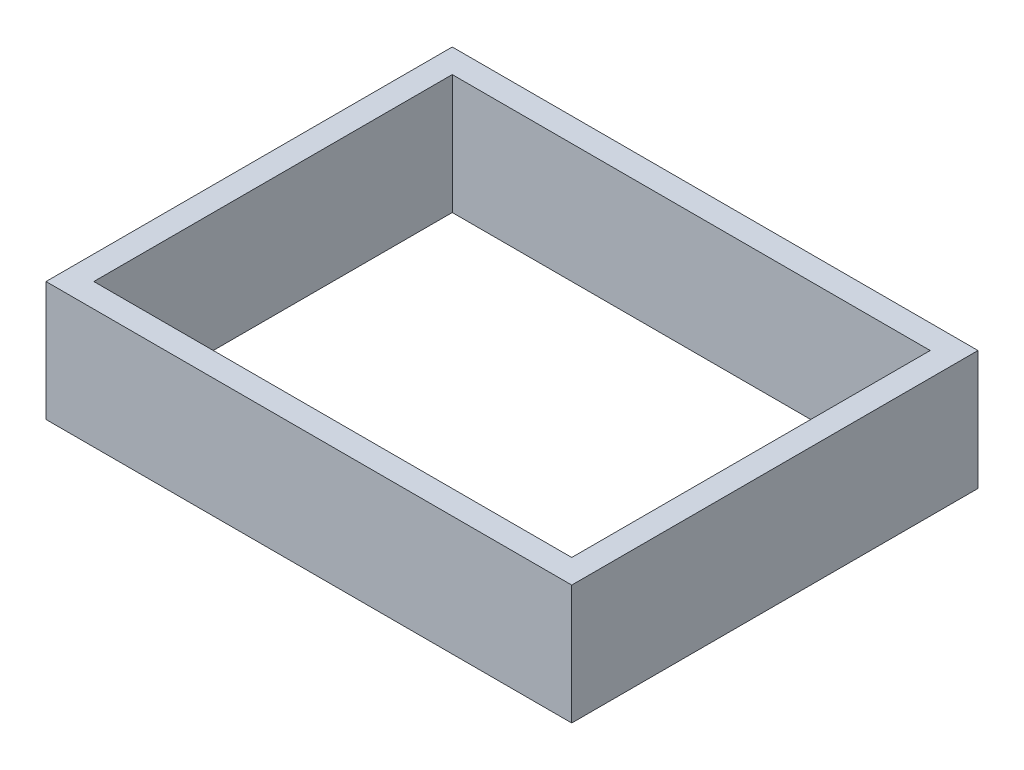
ISO-10303-21;
HEADER;
FILE_DESCRIPTION(('STEP AP214'),'2;1');
FILE_NAME('part.step','',(''),(''),'','','');
FILE_SCHEMA(('AUTOMOTIVE_DESIGN { 1 0 10303 214 1 1 1 1 }'));
ENDSEC;
DATA;
#1=APPLICATION_CONTEXT('core data for automotive mechanical design processes');
#2=APPLICATION_PROTOCOL_DEFINITION('international standard','automotive_design',2000,#1);
#3=PRODUCT_CONTEXT('',#1,'mechanical');
#4=PRODUCT('Part','Part','',(#3));
#5=PRODUCT_RELATED_PRODUCT_CATEGORY('part','',(#4));
#6=PRODUCT_DEFINITION_FORMATION('','',#4);
#7=PRODUCT_DEFINITION_CONTEXT('part definition',#1,'design');
#8=PRODUCT_DEFINITION('design','',#6,#7);
#9=PRODUCT_DEFINITION_SHAPE('','',#8);
#10=(LENGTH_UNIT() NAMED_UNIT(*) SI_UNIT(.MILLI.,.METRE.));
#11=(NAMED_UNIT(*) PLANE_ANGLE_UNIT() SI_UNIT($,.RADIAN.));
#12=(NAMED_UNIT(*) SI_UNIT($,.STERADIAN.) SOLID_ANGLE_UNIT());
#13=UNCERTAINTY_MEASURE_WITH_UNIT(LENGTH_MEASURE(1.E-05),#10,'distance_accuracy_value','');
#14=(GEOMETRIC_REPRESENTATION_CONTEXT(3) GLOBAL_UNCERTAINTY_ASSIGNED_CONTEXT((#13)) GLOBAL_UNIT_ASSIGNED_CONTEXT((#10,
#11,#12)) REPRESENTATION_CONTEXT('',''));
#15=CARTESIAN_POINT('',(0.,0.,0.));
#16=DIRECTION('',(0.,0.,1.));
#17=DIRECTION('',(1.,0.,0.));
#18=AXIS2_PLACEMENT_3D('',#15,#16,#17);
#19=CARTESIAN_POINT('',(0.,10.,0.));
#20=DIRECTION('',(0.,1.,0.));
#21=DIRECTION('',(0.,0.,1.));
#22=AXIS2_PLACEMENT_3D('',#19,#20,#21);
#23=PLANE('',#22);
#24=DIRECTION('',(1.,0.,0.));
#25=VECTOR('',#24,1.);
#26=CARTESIAN_POINT('',(-22.,10.,17.));
#27=LINE('',#26,#25);
#28=CARTESIAN_POINT('',(-22.,10.,17.));
#29=VERTEX_POINT('',#28);
#30=CARTESIAN_POINT('',(22.,10.,17.));
#31=VERTEX_POINT('',#30);
#32=EDGE_CURVE('E136',#29,#31,#27,.T.);
#33=ORIENTED_EDGE('',*,*,#32,.T.);
#34=DIRECTION('',(0.,0.,-1.));
#35=VECTOR('',#34,1.);
#36=CARTESIAN_POINT('',(22.,10.,17.));
#37=LINE('',#36,#35);
#38=CARTESIAN_POINT('',(22.,10.,-17.));
#39=VERTEX_POINT('',#38);
#40=EDGE_CURVE('E139',#31,#39,#37,.T.);
#41=ORIENTED_EDGE('',*,*,#40,.T.);
#42=DIRECTION('',(-1.,0.,0.));
#43=VECTOR('',#42,1.);
#44=CARTESIAN_POINT('',(-22.,10.,-17.));
#45=LINE('',#44,#43);
#46=CARTESIAN_POINT('',(-22.,10.,-17.));
#47=VERTEX_POINT('',#46);
#48=EDGE_CURVE('E142',#39,#47,#45,.T.);
#49=ORIENTED_EDGE('',*,*,#48,.T.);
#50=DIRECTION('',(0.,0.,1.));
#51=VECTOR('',#50,1.);
#52=CARTESIAN_POINT('',(-22.,10.,17.));
#53=LINE('',#52,#51);
#54=EDGE_CURVE('E144',#47,#29,#53,.T.);
#55=ORIENTED_EDGE('',*,*,#54,.T.);
#56=EDGE_LOOP('',(#33,#41,#49,#55));
#57=FACE_BOUND('',#56,.T.);
#58=DIRECTION('',(-1.,0.,0.));
#59=VECTOR('',#58,1.);
#60=CARTESIAN_POINT('',(-20.,10.,-15.));
#61=LINE('',#60,#59);
#62=CARTESIAN_POINT('',(20.,10.,-15.));
#63=VERTEX_POINT('',#62);
#64=CARTESIAN_POINT('',(-20.,10.,-15.));
#65=VERTEX_POINT('',#64);
#66=EDGE_CURVE('E108',#63,#65,#61,.T.);
#67=ORIENTED_EDGE('',*,*,#66,.F.);
#68=DIRECTION('',(0.,0.,-1.));
#69=VECTOR('',#68,1.);
#70=CARTESIAN_POINT('',(20.,10.,15.));
#71=LINE('',#70,#69);
#72=CARTESIAN_POINT('',(20.,10.,15.));
#73=VERTEX_POINT('',#72);
#74=EDGE_CURVE('E100',#73,#63,#71,.T.);
#75=ORIENTED_EDGE('',*,*,#74,.F.);
#76=DIRECTION('',(1.,0.,0.));
#77=VECTOR('',#76,1.);
#78=CARTESIAN_POINT('',(-20.,10.,15.));
#79=LINE('',#78,#77);
#80=CARTESIAN_POINT('',(-20.,10.,15.));
#81=VERTEX_POINT('',#80);
#82=EDGE_CURVE('E122',#81,#73,#79,.T.);
#83=ORIENTED_EDGE('',*,*,#82,.F.);
#84=DIRECTION('',(0.,0.,1.));
#85=VECTOR('',#84,1.);
#86=CARTESIAN_POINT('',(-20.,10.,15.));
#87=LINE('',#86,#85);
#88=EDGE_CURVE('E120',#65,#81,#87,.T.);
#89=ORIENTED_EDGE('',*,*,#88,.F.);
#90=EDGE_LOOP('',(#67,#75,#83,#89));
#91=FACE_BOUND('',#90,.T.);
#92=ADVANCED_FACE('F35',(#57,#91),#23,.T.);
#93=CARTESIAN_POINT('',(0.,0.,0.));
#94=DIRECTION('',(0.,1.,0.));
#95=DIRECTION('',(0.,0.,1.));
#96=AXIS2_PLACEMENT_3D('',#93,#94,#95);
#97=PLANE('',#96);
#98=DIRECTION('',(1.,0.,0.));
#99=VECTOR('',#98,1.);
#100=CARTESIAN_POINT('',(-22.,0.,17.));
#101=LINE('',#100,#99);
#102=CARTESIAN_POINT('',(-22.,0.,17.));
#103=VERTEX_POINT('',#102);
#104=CARTESIAN_POINT('',(22.,0.,17.));
#105=VERTEX_POINT('',#104);
#106=EDGE_CURVE('E116',#103,#105,#101,.T.);
#107=ORIENTED_EDGE('',*,*,#106,.F.);
#108=DIRECTION('',(0.,0.,1.));
#109=VECTOR('',#108,1.);
#110=CARTESIAN_POINT('',(-22.,0.,17.));
#111=LINE('',#110,#109);
#112=CARTESIAN_POINT('',(-22.,0.,-17.));
#113=VERTEX_POINT('',#112);
#114=EDGE_CURVE('E140',#113,#103,#111,.T.);
#115=ORIENTED_EDGE('',*,*,#114,.F.);
#116=DIRECTION('',(-1.,0.,0.));
#117=VECTOR('',#116,1.);
#118=CARTESIAN_POINT('',(-22.,0.,-17.));
#119=LINE('',#118,#117);
#120=CARTESIAN_POINT('',(22.,0.,-17.));
#121=VERTEX_POINT('',#120);
#122=EDGE_CURVE('E151',#121,#113,#119,.T.);
#123=ORIENTED_EDGE('',*,*,#122,.F.);
#124=DIRECTION('',(0.,0.,-1.));
#125=VECTOR('',#124,1.);
#126=CARTESIAN_POINT('',(22.,0.,17.));
#127=LINE('',#126,#125);
#128=EDGE_CURVE('E149',#105,#121,#127,.T.);
#129=ORIENTED_EDGE('',*,*,#128,.F.);
#130=EDGE_LOOP('',(#107,#115,#123,#129));
#131=FACE_BOUND('',#130,.T.);
#132=DIRECTION('',(0.,0.,-1.));
#133=VECTOR('',#132,1.);
#134=CARTESIAN_POINT('',(20.,0.,15.));
#135=LINE('',#134,#133);
#136=CARTESIAN_POINT('',(20.,0.,15.));
#137=VERTEX_POINT('',#136);
#138=CARTESIAN_POINT('',(20.,0.,-15.));
#139=VERTEX_POINT('',#138);
#140=EDGE_CURVE('E58',#137,#139,#135,.T.);
#141=ORIENTED_EDGE('',*,*,#140,.T.);
#142=DIRECTION('',(-1.,0.,0.));
#143=VECTOR('',#142,1.);
#144=CARTESIAN_POINT('',(-20.,0.,-15.));
#145=LINE('',#144,#143);
#146=CARTESIAN_POINT('',(-20.,0.,-15.));
#147=VERTEX_POINT('',#146);
#148=EDGE_CURVE('E115',#139,#147,#145,.T.);
#149=ORIENTED_EDGE('',*,*,#148,.T.);
#150=DIRECTION('',(0.,0.,1.));
#151=VECTOR('',#150,1.);
#152=CARTESIAN_POINT('',(-20.,0.,15.));
#153=LINE('',#152,#151);
#154=CARTESIAN_POINT('',(-20.,0.,15.));
#155=VERTEX_POINT('',#154);
#156=EDGE_CURVE('E128',#147,#155,#153,.T.);
#157=ORIENTED_EDGE('',*,*,#156,.T.);
#158=DIRECTION('',(1.,0.,0.));
#159=VECTOR('',#158,1.);
#160=CARTESIAN_POINT('',(-20.,0.,15.));
#161=LINE('',#160,#159);
#162=EDGE_CURVE('E109',#155,#137,#161,.T.);
#163=ORIENTED_EDGE('',*,*,#162,.T.);
#164=EDGE_LOOP('',(#141,#149,#157,#163));
#165=FACE_BOUND('',#164,.T.);
#166=ADVANCED_FACE('F169',(#131,#165),#97,.F.);
#167=CARTESIAN_POINT('',(-22.,10.,17.));
#168=DIRECTION('',(0.,0.,-1.));
#169=DIRECTION('',(-1.,0.,0.));
#170=AXIS2_PLACEMENT_3D('',#167,#168,#169);
#171=PLANE('',#170);
#172=ORIENTED_EDGE('',*,*,#106,.T.);
#173=DIRECTION('',(0.,-1.,0.));
#174=VECTOR('',#173,1.);
#175=CARTESIAN_POINT('',(22.,10.,17.));
#176=LINE('',#175,#174);
#177=EDGE_CURVE('E11',#31,#105,#176,.T.);
#178=ORIENTED_EDGE('',*,*,#177,.F.);
#179=ORIENTED_EDGE('',*,*,#32,.F.);
#180=DIRECTION('',(0.,-1.,0.));
#181=VECTOR('',#180,1.);
#182=CARTESIAN_POINT('',(-22.,10.,17.));
#183=LINE('',#182,#181);
#184=EDGE_CURVE('E146',#29,#103,#183,.T.);
#185=ORIENTED_EDGE('',*,*,#184,.T.);
#186=EDGE_LOOP('',(#172,#178,#179,#185));
#187=FACE_BOUND('',#186,.T.);
#188=ADVANCED_FACE('F37',(#187),#171,.F.);
#189=CARTESIAN_POINT('',(22.,10.,17.));
#190=DIRECTION('',(-1.,0.,0.));
#191=DIRECTION('',(0.,0.,1.));
#192=AXIS2_PLACEMENT_3D('',#189,#190,#191);
#193=PLANE('',#192);
#194=ORIENTED_EDGE('',*,*,#128,.T.);
#195=DIRECTION('',(0.,-1.,0.));
#196=VECTOR('',#195,1.);
#197=CARTESIAN_POINT('',(22.,10.,-17.));
#198=LINE('',#197,#196);
#199=EDGE_CURVE('E43',#39,#121,#198,.T.);
#200=ORIENTED_EDGE('',*,*,#199,.F.);
#201=ORIENTED_EDGE('',*,*,#40,.F.);
#202=ORIENTED_EDGE('',*,*,#177,.T.);
#203=EDGE_LOOP('',(#194,#200,#201,#202));
#204=FACE_BOUND('',#203,.T.);
#205=ADVANCED_FACE('F179',(#204),#193,.F.);
#206=CARTESIAN_POINT('',(-22.,10.,-17.));
#207=DIRECTION('',(0.,0.,1.));
#208=DIRECTION('',(1.,0.,0.));
#209=AXIS2_PLACEMENT_3D('',#206,#207,#208);
#210=PLANE('',#209);
#211=ORIENTED_EDGE('',*,*,#122,.T.);
#212=DIRECTION('',(0.,-1.,0.));
#213=VECTOR('',#212,1.);
#214=CARTESIAN_POINT('',(-22.,10.,-17.));
#215=LINE('',#214,#213);
#216=EDGE_CURVE('E156',#47,#113,#215,.T.);
#217=ORIENTED_EDGE('',*,*,#216,.F.);
#218=ORIENTED_EDGE('',*,*,#48,.F.);
#219=ORIENTED_EDGE('',*,*,#199,.T.);
#220=EDGE_LOOP('',(#211,#217,#218,#219));
#221=FACE_BOUND('',#220,.T.);
#222=ADVANCED_FACE('F163',(#221),#210,.F.);
#223=CARTESIAN_POINT('',(-22.,10.,17.));
#224=DIRECTION('',(1.,0.,0.));
#225=DIRECTION('',(0.,0.,-1.));
#226=AXIS2_PLACEMENT_3D('',#223,#224,#225);
#227=PLANE('',#226);
#228=ORIENTED_EDGE('',*,*,#114,.T.);
#229=ORIENTED_EDGE('',*,*,#184,.F.);
#230=ORIENTED_EDGE('',*,*,#54,.F.);
#231=ORIENTED_EDGE('',*,*,#216,.T.);
#232=EDGE_LOOP('',(#228,#229,#230,#231));
#233=FACE_BOUND('',#232,.T.);
#234=ADVANCED_FACE('F173',(#233),#227,.F.);
#235=CARTESIAN_POINT('',(20.,10.,15.));
#236=DIRECTION('',(-1.,0.,0.));
#237=DIRECTION('',(0.,0.,1.));
#238=AXIS2_PLACEMENT_3D('',#235,#236,#237);
#239=PLANE('',#238);
#240=ORIENTED_EDGE('',*,*,#140,.F.);
#241=DIRECTION('',(0.,-1.,0.));
#242=VECTOR('',#241,1.);
#243=CARTESIAN_POINT('',(20.,10.,15.));
#244=LINE('',#243,#242);
#245=EDGE_CURVE('E104',#73,#137,#244,.T.);
#246=ORIENTED_EDGE('',*,*,#245,.F.);
#247=ORIENTED_EDGE('',*,*,#74,.T.);
#248=DIRECTION('',(0.,-1.,0.));
#249=VECTOR('',#248,1.);
#250=CARTESIAN_POINT('',(20.,10.,-15.));
#251=LINE('',#250,#249);
#252=EDGE_CURVE('E103',#63,#139,#251,.T.);
#253=ORIENTED_EDGE('',*,*,#252,.T.);
#254=EDGE_LOOP('',(#240,#246,#247,#253));
#255=FACE_BOUND('',#254,.T.);
#256=ADVANCED_FACE('F102',(#255),#239,.T.);
#257=CARTESIAN_POINT('',(-20.,10.,-15.));
#258=DIRECTION('',(0.,0.,1.));
#259=DIRECTION('',(1.,0.,0.));
#260=AXIS2_PLACEMENT_3D('',#257,#258,#259);
#261=PLANE('',#260);
#262=ORIENTED_EDGE('',*,*,#148,.F.);
#263=ORIENTED_EDGE('',*,*,#252,.F.);
#264=ORIENTED_EDGE('',*,*,#66,.T.);
#265=DIRECTION('',(0.,-1.,0.));
#266=VECTOR('',#265,1.);
#267=CARTESIAN_POINT('',(-20.,10.,-15.));
#268=LINE('',#267,#266);
#269=EDGE_CURVE('E117',#65,#147,#268,.T.);
#270=ORIENTED_EDGE('',*,*,#269,.T.);
#271=EDGE_LOOP('',(#262,#263,#264,#270));
#272=FACE_BOUND('',#271,.T.);
#273=ADVANCED_FACE('F112',(#272),#261,.T.);
#274=CARTESIAN_POINT('',(-20.,10.,15.));
#275=DIRECTION('',(1.,0.,0.));
#276=DIRECTION('',(0.,0.,-1.));
#277=AXIS2_PLACEMENT_3D('',#274,#275,#276);
#278=PLANE('',#277);
#279=ORIENTED_EDGE('',*,*,#156,.F.);
#280=ORIENTED_EDGE('',*,*,#269,.F.);
#281=ORIENTED_EDGE('',*,*,#88,.T.);
#282=DIRECTION('',(0.,-1.,0.));
#283=VECTOR('',#282,1.);
#284=CARTESIAN_POINT('',(-20.,10.,15.));
#285=LINE('',#284,#283);
#286=EDGE_CURVE('E50',#81,#155,#285,.T.);
#287=ORIENTED_EDGE('',*,*,#286,.T.);
#288=EDGE_LOOP('',(#279,#280,#281,#287));
#289=FACE_BOUND('',#288,.T.);
#290=ADVANCED_FACE('F202',(#289),#278,.T.);
#291=CARTESIAN_POINT('',(-20.,10.,15.));
#292=DIRECTION('',(0.,0.,-1.));
#293=DIRECTION('',(-1.,0.,0.));
#294=AXIS2_PLACEMENT_3D('',#291,#292,#293);
#295=PLANE('',#294);
#296=ORIENTED_EDGE('',*,*,#162,.F.);
#297=ORIENTED_EDGE('',*,*,#286,.F.);
#298=ORIENTED_EDGE('',*,*,#82,.T.);
#299=ORIENTED_EDGE('',*,*,#245,.T.);
#300=EDGE_LOOP('',(#296,#297,#298,#299));
#301=FACE_BOUND('',#300,.T.);
#302=ADVANCED_FACE('F206',(#301),#295,.T.);
#303=CLOSED_SHELL('',(#92,#166,#188,#205,#222,#234,#256,#273,#290,#302));
#304=MANIFOLD_SOLID_BREP('B2',#303);
#305=ADVANCED_BREP_SHAPE_REPRESENTATION('',(#18,#304),#14);
#306=SHAPE_DEFINITION_REPRESENTATION(#9,#305);
ENDSEC;
END-ISO-10303-21;
